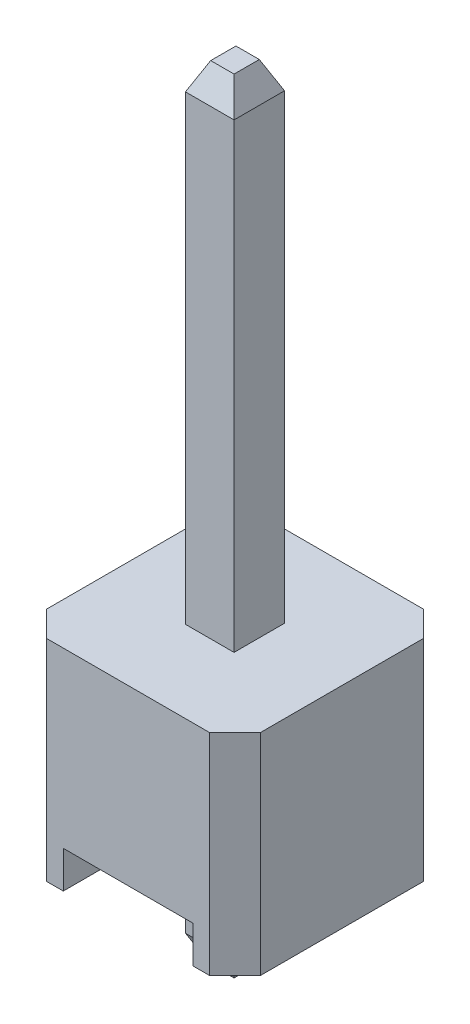
ISO-10303-21;
HEADER;
FILE_DESCRIPTION(('STEP AP214'),'2;1');
FILE_NAME('part.step','',(''),(''),'','','');
FILE_SCHEMA(('AUTOMOTIVE_DESIGN { 1 0 10303 214 1 1 1 1 }'));
ENDSEC;
DATA;
#1=APPLICATION_CONTEXT('core data for automotive mechanical design processes');
#2=APPLICATION_PROTOCOL_DEFINITION('international standard','automotive_design',2000,#1);
#3=PRODUCT_CONTEXT('',#1,'mechanical');
#4=PRODUCT('Part','Part','',(#3));
#5=PRODUCT_RELATED_PRODUCT_CATEGORY('part','',(#4));
#6=PRODUCT_DEFINITION_FORMATION('','',#4);
#7=PRODUCT_DEFINITION_CONTEXT('part definition',#1,'design');
#8=PRODUCT_DEFINITION('design','',#6,#7);
#9=PRODUCT_DEFINITION_SHAPE('','',#8);
#10=(LENGTH_UNIT() NAMED_UNIT(*) SI_UNIT(.MILLI.,.METRE.));
#11=(NAMED_UNIT(*) PLANE_ANGLE_UNIT() SI_UNIT($,.RADIAN.));
#12=(NAMED_UNIT(*) SI_UNIT($,.STERADIAN.) SOLID_ANGLE_UNIT());
#13=UNCERTAINTY_MEASURE_WITH_UNIT(LENGTH_MEASURE(1.E-05),#10,'distance_accuracy_value','');
#14=(GEOMETRIC_REPRESENTATION_CONTEXT(3) GLOBAL_UNCERTAINTY_ASSIGNED_CONTEXT((#13)) GLOBAL_UNIT_ASSIGNED_CONTEXT((#10,
#11,#12)) REPRESENTATION_CONTEXT('',''));
#15=CARTESIAN_POINT('',(0.,0.,0.));
#16=DIRECTION('',(0.,0.,1.));
#17=DIRECTION('',(1.,0.,0.));
#18=AXIS2_PLACEMENT_3D('',#15,#16,#17);
#19=CARTESIAN_POINT('',(-19.1812561045914,-5.69124998633488,-6.66837288882801));
#20=DIRECTION('',(0.,-1.,0.));
#21=DIRECTION('',(0.,0.,-1.));
#22=AXIS2_PLACEMENT_3D('',#19,#20,#21);
#23=PLANE('',#22);
#24=DIRECTION('',(0.,0.,1.));
#25=VECTOR('',#24,1.);
#26=CARTESIAN_POINT('',(-19.0312561045914,-5.69124998633488,-6.06837288882801));
#27=LINE('',#26,#25);
#28=CARTESIAN_POINT('',(-19.0312561045914,-5.69124998633488,-6.21837288882801));
#29=VERTEX_POINT('',#28);
#30=CARTESIAN_POINT('',(-19.0312561045914,-5.69124998633488,-6.51837288882801));
#31=VERTEX_POINT('',#30);
#32=EDGE_CURVE('E194',#29,#31,#27,.F.);
#33=ORIENTED_EDGE('',*,*,#32,.T.);
#34=DIRECTION('',(1.,0.,0.));
#35=VECTOR('',#34,1.);
#36=CARTESIAN_POINT('',(-19.1812561045914,-5.69124998633488,-6.51837288882801));
#37=LINE('',#36,#35);
#38=CARTESIAN_POINT('',(-18.7537499744834,-5.69124998633488,-6.51837288882801));
#39=VERTEX_POINT('',#38);
#40=EDGE_CURVE('E179',#31,#39,#37,.T.);
#41=ORIENTED_EDGE('',*,*,#40,.T.);
#42=DIRECTION('',(0.,0.,1.));
#43=VECTOR('',#42,1.);
#44=CARTESIAN_POINT('',(-18.7537499744834,-5.69124998633488,-6.66837288882801));
#45=LINE('',#44,#43);
#46=CARTESIAN_POINT('',(-18.7537499744834,-5.69124998633488,-6.21837288882801));
#47=VERTEX_POINT('',#46);
#48=EDGE_CURVE('E20',#39,#47,#45,.T.);
#49=ORIENTED_EDGE('',*,*,#48,.T.);
#50=DIRECTION('',(1.,0.,0.));
#51=VECTOR('',#50,1.);
#52=CARTESIAN_POINT('',(-18.6037499744834,-5.69124998633488,-6.21837288882801));
#53=LINE('',#52,#51);
#54=EDGE_CURVE('E174',#47,#29,#53,.F.);
#55=ORIENTED_EDGE('',*,*,#54,.T.);
#56=EDGE_LOOP('',(#33,#41,#49,#55));
#57=FACE_BOUND('',#56,.T.);
#58=ADVANCED_FACE('F17',(#57),#23,.T.);
#59=CARTESIAN_POINT('',(-18.6037499744834,-5.36957394825845,-6.66837288882801));
#60=DIRECTION('',(-0.90630778703665,0.4226182617407,0.));
#61=DIRECTION('',(-0.4226182617407,-0.90630778703665,0.));
#62=AXIS2_PLACEMENT_3D('',#59,#60,#61);
#63=PLANE('',#62);
#64=DIRECTION('',(0.,0.,-1.));
#65=VECTOR('',#64,1.);
#66=CARTESIAN_POINT('',(-18.6037499744834,-5.36957394825845,-6.66837288882801));
#67=LINE('',#66,#65);
#68=CARTESIAN_POINT('',(-18.6037499744834,-5.36957394825845,-6.06837288882801));
#69=VERTEX_POINT('',#68);
#70=CARTESIAN_POINT('',(-18.6037499744834,-5.36957394825845,-6.66837288882801));
#71=VERTEX_POINT('',#70);
#72=EDGE_CURVE('E186',#69,#71,#67,.T.);
#73=ORIENTED_EDGE('',*,*,#72,.F.);
#74=DIRECTION('',(-0.389281620635034,-0.834817129478984,-0.389281620635025));
#75=VECTOR('',#74,1.);
#76=CARTESIAN_POINT('',(-18.6037499744834,-5.36957394825845,-6.06837288882801));
#77=LINE('',#76,#75);
#78=EDGE_CURVE('E182',#69,#47,#77,.T.);
#79=ORIENTED_EDGE('',*,*,#78,.T.);
#80=ORIENTED_EDGE('',*,*,#48,.F.);
#81=DIRECTION('',(0.389281620635034,0.834817129478983,-0.389281620635025));
#82=VECTOR('',#81,1.);
#83=CARTESIAN_POINT('',(-18.7537499744834,-5.69124998633488,-6.51837288882801));
#84=LINE('',#83,#82);
#85=EDGE_CURVE('E202',#39,#71,#84,.T.);
#86=ORIENTED_EDGE('',*,*,#85,.T.);
#87=EDGE_LOOP('',(#73,#79,#80,#86));
#88=FACE_BOUND('',#87,.T.);
#89=ADVANCED_FACE('F184',(#88),#63,.F.);
#90=CARTESIAN_POINT('',(-18.6037499744834,-5.36957394825845,-6.06837288882801));
#91=DIRECTION('',(0.,0.422618261740701,-0.906307787036649));
#92=DIRECTION('',(0.,0.906307787036649,0.422618261740701));
#93=AXIS2_PLACEMENT_3D('',#90,#91,#92);
#94=PLANE('',#93);
#95=ORIENTED_EDGE('',*,*,#54,.F.);
#96=ORIENTED_EDGE('',*,*,#78,.F.);
#97=DIRECTION('',(1.,0.,0.));
#98=VECTOR('',#97,1.);
#99=CARTESIAN_POINT('',(-18.6037499744834,-5.36957394825845,-6.06837288882801));
#100=LINE('',#99,#98);
#101=CARTESIAN_POINT('',(-19.1812561045914,-5.36957394825845,-6.06837288882801));
#102=VERTEX_POINT('',#101);
#103=EDGE_CURVE('E205',#102,#69,#100,.T.);
#104=ORIENTED_EDGE('',*,*,#103,.F.);
#105=DIRECTION('',(0.389281620635027,-0.834817129478985,-0.389281620635029));
#106=VECTOR('',#105,1.);
#107=CARTESIAN_POINT('',(-19.1812561045914,-5.36957394825845,-6.06837288882801));
#108=LINE('',#107,#106);
#109=EDGE_CURVE('E191',#102,#29,#108,.T.);
#110=ORIENTED_EDGE('',*,*,#109,.T.);
#111=EDGE_LOOP('',(#95,#96,#104,#110));
#112=FACE_BOUND('',#111,.T.);
#113=ADVANCED_FACE('F189',(#112),#94,.F.);
#114=CARTESIAN_POINT('',(-19.1812561045914,-5.36957394825845,-6.06837288882801));
#115=DIRECTION('',(0.906307787036649,0.422618261740701,0.));
#116=DIRECTION('',(-0.422618261740701,0.906307787036649,0.));
#117=AXIS2_PLACEMENT_3D('',#114,#115,#116);
#118=PLANE('',#117);
#119=ORIENTED_EDGE('',*,*,#32,.F.);
#120=ORIENTED_EDGE('',*,*,#109,.F.);
#121=DIRECTION('',(0.,0.,1.));
#122=VECTOR('',#121,1.);
#123=CARTESIAN_POINT('',(-19.1812561045914,-5.36957394825845,-6.06837288882801));
#124=LINE('',#123,#122);
#125=CARTESIAN_POINT('',(-19.1812561045914,-5.36957394825845,-6.66837288882801));
#126=VERTEX_POINT('',#125);
#127=EDGE_CURVE('E211',#126,#102,#124,.T.);
#128=ORIENTED_EDGE('',*,*,#127,.F.);
#129=DIRECTION('',(0.389281620635027,-0.834817129478986,0.389281620635027));
#130=VECTOR('',#129,1.);
#131=CARTESIAN_POINT('',(-19.1812561045914,-5.36957394825845,-6.66837288882801));
#132=LINE('',#131,#130);
#133=EDGE_CURVE('E198',#126,#31,#132,.T.);
#134=ORIENTED_EDGE('',*,*,#133,.T.);
#135=EDGE_LOOP('',(#119,#120,#128,#134));
#136=FACE_BOUND('',#135,.T.);
#137=ADVANCED_FACE('F518',(#136),#118,.F.);
#138=CARTESIAN_POINT('',(-19.1812561045914,-5.36957394825845,-6.66837288882801));
#139=DIRECTION('',(0.,0.422618261740701,0.906307787036649));
#140=DIRECTION('',(0.,-0.906307787036649,0.422618261740701));
#141=AXIS2_PLACEMENT_3D('',#138,#139,#140);
#142=PLANE('',#141);
#143=ORIENTED_EDGE('',*,*,#40,.F.);
#144=ORIENTED_EDGE('',*,*,#133,.F.);
#145=DIRECTION('',(-1.,0.,0.));
#146=VECTOR('',#145,1.);
#147=CARTESIAN_POINT('',(-19.1812561045914,-5.36957394825845,-6.66837288882801));
#148=LINE('',#147,#146);
#149=EDGE_CURVE('E220',#71,#126,#148,.T.);
#150=ORIENTED_EDGE('',*,*,#149,.F.);
#151=ORIENTED_EDGE('',*,*,#85,.F.);
#152=EDGE_LOOP('',(#143,#144,#150,#151));
#153=FACE_BOUND('',#152,.T.);
#154=ADVANCED_FACE('F514',(#153),#142,.F.);
#155=CARTESIAN_POINT('',(-18.6037499744834,-5.69124998633488,-6.66837288882801));
#156=DIRECTION('',(1.,0.,0.));
#157=DIRECTION('',(0.,0.,-1.));
#158=AXIS2_PLACEMENT_3D('',#155,#156,#157);
#159=PLANE('',#158);
#160=DIRECTION('',(0.,1.,0.));
#161=VECTOR('',#160,1.);
#162=CARTESIAN_POINT('',(-18.6037499744834,-5.69124998633488,-6.66837288882801));
#163=LINE('',#162,#161);
#164=CARTESIAN_POINT('',(-18.6037499744834,-4.25124998633488,-6.66837288882801));
#165=VERTEX_POINT('',#164);
#166=EDGE_CURVE('E217',#165,#71,#163,.F.);
#167=ORIENTED_EDGE('',*,*,#166,.F.);
#168=DIRECTION('',(0.,0.,1.));
#169=VECTOR('',#168,1.);
#170=CARTESIAN_POINT('',(-18.6037499744834,-4.25124998633488,-5.09837288882801));
#171=LINE('',#170,#169);
#172=CARTESIAN_POINT('',(-18.6037499744834,-4.25124998633488,-6.06837288882801));
#173=VERTEX_POINT('',#172);
#174=EDGE_CURVE('E230',#165,#173,#171,.T.);
#175=ORIENTED_EDGE('',*,*,#174,.T.);
#176=DIRECTION('',(0.,1.,0.));
#177=VECTOR('',#176,1.);
#178=CARTESIAN_POINT('',(-18.6037499744834,-5.69124998633488,-6.06837288882801));
#179=LINE('',#178,#177);
#180=EDGE_CURVE('E208',#69,#173,#179,.T.);
#181=ORIENTED_EDGE('',*,*,#180,.F.);
#182=ORIENTED_EDGE('',*,*,#72,.T.);
#183=EDGE_LOOP('',(#167,#175,#181,#182));
#184=FACE_BOUND('',#183,.T.);
#185=ADVANCED_FACE('F510',(#184),#159,.T.);
#186=CARTESIAN_POINT('',(-18.6037499744834,-5.69124998633488,-6.06837288882801));
#187=DIRECTION('',(0.,0.,1.));
#188=DIRECTION('',(1.,0.,0.));
#189=AXIS2_PLACEMENT_3D('',#186,#187,#188);
#190=PLANE('',#189);
#191=ORIENTED_EDGE('',*,*,#180,.T.);
#192=DIRECTION('',(1.,0.,0.));
#193=VECTOR('',#192,1.);
#194=CARTESIAN_POINT('',(-18.1225030395374,-4.25124998633488,-6.06837288882801));
#195=LINE('',#194,#193);
#196=CARTESIAN_POINT('',(-19.1812561045914,-4.25124998633488,-6.06837288882801));
#197=VERTEX_POINT('',#196);
#198=EDGE_CURVE('E232',#173,#197,#195,.F.);
#199=ORIENTED_EDGE('',*,*,#198,.T.);
#200=DIRECTION('',(0.,1.,0.));
#201=VECTOR('',#200,1.);
#202=CARTESIAN_POINT('',(-19.1812561045914,-5.69124998633488,-6.06837288882801));
#203=LINE('',#202,#201);
#204=EDGE_CURVE('E214',#102,#197,#203,.T.);
#205=ORIENTED_EDGE('',*,*,#204,.F.);
#206=ORIENTED_EDGE('',*,*,#103,.T.);
#207=EDGE_LOOP('',(#191,#199,#205,#206));
#208=FACE_BOUND('',#207,.T.);
#209=ADVANCED_FACE('F506',(#208),#190,.T.);
#210=CARTESIAN_POINT('',(-19.1812561045914,-5.69124998633488,-6.06837288882801));
#211=DIRECTION('',(-1.,0.,0.));
#212=DIRECTION('',(0.,0.,1.));
#213=AXIS2_PLACEMENT_3D('',#210,#211,#212);
#214=PLANE('',#213);
#215=ORIENTED_EDGE('',*,*,#204,.T.);
#216=DIRECTION('',(0.,0.,1.));
#217=VECTOR('',#216,1.);
#218=CARTESIAN_POINT('',(-19.1812561045914,-4.25124998633488,-5.09837288882801));
#219=LINE('',#218,#217);
#220=CARTESIAN_POINT('',(-19.1812561045914,-4.25124998633488,-6.66837288882801));
#221=VERTEX_POINT('',#220);
#222=EDGE_CURVE('E234',#197,#221,#219,.F.);
#223=ORIENTED_EDGE('',*,*,#222,.T.);
#224=DIRECTION('',(0.,1.,0.));
#225=VECTOR('',#224,1.);
#226=CARTESIAN_POINT('',(-19.1812561045914,-5.69124998633488,-6.66837288882801));
#227=LINE('',#226,#225);
#228=EDGE_CURVE('E223',#126,#221,#227,.T.);
#229=ORIENTED_EDGE('',*,*,#228,.F.);
#230=ORIENTED_EDGE('',*,*,#127,.T.);
#231=EDGE_LOOP('',(#215,#223,#229,#230));
#232=FACE_BOUND('',#231,.T.);
#233=ADVANCED_FACE('F502',(#232),#214,.T.);
#234=CARTESIAN_POINT('',(-19.1812561045914,-5.69124998633488,-6.66837288882801));
#235=DIRECTION('',(0.,0.,-1.));
#236=DIRECTION('',(-1.,0.,0.));
#237=AXIS2_PLACEMENT_3D('',#234,#235,#236);
#238=PLANE('',#237);
#239=ORIENTED_EDGE('',*,*,#228,.T.);
#240=DIRECTION('',(1.,0.,0.));
#241=VECTOR('',#240,1.);
#242=CARTESIAN_POINT('',(-18.1225030395374,-4.25124998633488,-6.66837288882801));
#243=LINE('',#242,#241);
#244=EDGE_CURVE('E236',#221,#165,#243,.T.);
#245=ORIENTED_EDGE('',*,*,#244,.T.);
#246=ORIENTED_EDGE('',*,*,#166,.T.);
#247=ORIENTED_EDGE('',*,*,#149,.T.);
#248=EDGE_LOOP('',(#239,#245,#246,#247));
#249=FACE_BOUND('',#248,.T.);
#250=ADVANCED_FACE('F498',(#249),#238,.T.);
#251=CARTESIAN_POINT('',(-18.1225030395374,-4.25124998633488,-5.09837288882801));
#252=DIRECTION('',(0.,1.,0.));
#253=DIRECTION('',(0.,0.,1.));
#254=AXIS2_PLACEMENT_3D('',#251,#252,#253);
#255=PLANE('',#254);
#256=ORIENTED_EDGE('',*,*,#222,.F.);
#257=ORIENTED_EDGE('',*,*,#198,.F.);
#258=ORIENTED_EDGE('',*,*,#174,.F.);
#259=ORIENTED_EDGE('',*,*,#244,.F.);
#260=EDGE_LOOP('',(#256,#257,#258,#259));
#261=FACE_BOUND('',#260,.T.);
#262=DIRECTION('',(0.,0.,1.));
#263=VECTOR('',#262,1.);
#264=CARTESIAN_POINT('',(-19.6625030395374,-4.25124998633488,-5.09837288882801));
#265=LINE('',#264,#263);
#266=CARTESIAN_POINT('',(-19.6625030395374,-4.25124998633488,-5.09837288882801));
#267=VERTEX_POINT('',#266);
#268=CARTESIAN_POINT('',(-19.6625030395374,-4.25124998633488,-7.63837288882801));
#269=VERTEX_POINT('',#268);
#270=EDGE_CURVE('E241',#267,#269,#265,.F.);
#271=ORIENTED_EDGE('',*,*,#270,.T.);
#272=DIRECTION('',(1.,0.,0.));
#273=VECTOR('',#272,1.);
#274=CARTESIAN_POINT('',(-18.1225030395374,-4.25124998633488,-7.63837288882801));
#275=LINE('',#274,#273);
#276=CARTESIAN_POINT('',(-18.1225030395374,-4.25124998633488,-7.63837288882801));
#277=VERTEX_POINT('',#276);
#278=EDGE_CURVE('E226',#277,#269,#275,.F.);
#279=ORIENTED_EDGE('',*,*,#278,.F.);
#280=DIRECTION('',(0.,0.,-1.));
#281=VECTOR('',#280,1.);
#282=CARTESIAN_POINT('',(-18.1225030395374,-4.25124998633488,-5.09837288882801));
#283=LINE('',#282,#281);
#284=CARTESIAN_POINT('',(-18.1225030395374,-4.25124998633488,-5.09837288882801));
#285=VERTEX_POINT('',#284);
#286=EDGE_CURVE('E248',#277,#285,#283,.F.);
#287=ORIENTED_EDGE('',*,*,#286,.T.);
#288=DIRECTION('',(1.,0.,0.));
#289=VECTOR('',#288,1.);
#290=CARTESIAN_POINT('',(-18.1225030395374,-4.25124998633488,-5.09837288882801));
#291=LINE('',#290,#289);
#292=EDGE_CURVE('E228',#267,#285,#291,.T.);
#293=ORIENTED_EDGE('',*,*,#292,.F.);
#294=EDGE_LOOP('',(#271,#279,#287,#293));
#295=FACE_BOUND('',#294,.T.);
#296=ADVANCED_FACE('F495',(#261,#295),#255,.F.);
#297=CARTESIAN_POINT('',(-19.1812561045914,3.60875001366512,-6.51837288882801));
#298=DIRECTION('',(0.,0.422618261740697,-0.906307787036651));
#299=DIRECTION('',(0.,0.906307787036651,0.422618261740697));
#300=AXIS2_PLACEMENT_3D('',#297,#298,#299);
#301=PLANE('',#300);
#302=DIRECTION('',(-0.389281620635024,-0.834817129478989,-0.389281620635024));
#303=VECTOR('',#302,1.);
#304=CARTESIAN_POINT('',(-19.0312561045914,3.60875001366512,-6.51837288882801));
#305=LINE('',#304,#303);
#306=CARTESIAN_POINT('',(-19.0312561045914,3.60875001366512,-6.51837288882801));
#307=VERTEX_POINT('',#306);
#308=CARTESIAN_POINT('',(-19.1812561045914,3.28707397558869,-6.66837288882801));
#309=VERTEX_POINT('',#308);
#310=EDGE_CURVE('E263',#307,#309,#305,.T.);
#311=ORIENTED_EDGE('',*,*,#310,.F.);
#312=DIRECTION('',(1.,0.,0.));
#313=VECTOR('',#312,1.);
#314=CARTESIAN_POINT('',(-19.1812561045914,3.60875001366512,-6.51837288882801));
#315=LINE('',#314,#313);
#316=CARTESIAN_POINT('',(-18.7537499744834,3.60875001366512,-6.51837288882801));
#317=VERTEX_POINT('',#316);
#318=EDGE_CURVE('E256',#307,#317,#315,.T.);
#319=ORIENTED_EDGE('',*,*,#318,.T.);
#320=DIRECTION('',(-0.389281620635023,0.83481712947899,0.389281620635023));
#321=VECTOR('',#320,1.);
#322=CARTESIAN_POINT('',(-18.6037499744834,3.28707397558868,-6.66837288882801));
#323=LINE('',#322,#321);
#324=CARTESIAN_POINT('',(-18.6037499744834,3.28707397558869,-6.66837288882801));
#325=VERTEX_POINT('',#324);
#326=EDGE_CURVE('E253',#325,#317,#323,.T.);
#327=ORIENTED_EDGE('',*,*,#326,.F.);
#328=DIRECTION('',(-1.,0.,0.));
#329=VECTOR('',#328,1.);
#330=CARTESIAN_POINT('',(-19.1812561045914,3.28707397558869,-6.66837288882801));
#331=LINE('',#330,#329);
#332=EDGE_CURVE('E266',#309,#325,#331,.F.);
#333=ORIENTED_EDGE('',*,*,#332,.F.);
#334=EDGE_LOOP('',(#311,#319,#327,#333));
#335=FACE_BOUND('',#334,.T.);
#336=ADVANCED_FACE('F472',(#335),#301,.T.);
#337=CARTESIAN_POINT('',(-19.6625030395374,-4.25124998633488,-5.09837288882801));
#338=DIRECTION('',(-1.,0.,0.));
#339=DIRECTION('',(0.,0.,1.));
#340=AXIS2_PLACEMENT_3D('',#337,#338,#339);
#341=PLANE('',#340);
#342=DIRECTION('',(0.,1.,0.));
#343=VECTOR('',#342,1.);
#344=CARTESIAN_POINT('',(-19.6625030395374,-4.25124998633488,-7.63837288882801));
#345=LINE('',#344,#343);
#346=CARTESIAN_POINT('',(-19.6625030395374,-4.69124998633488,-7.63837288882801));
#347=VERTEX_POINT('',#346);
#348=EDGE_CURVE('E244',#269,#347,#345,.F.);
#349=ORIENTED_EDGE('',*,*,#348,.F.);
#350=ORIENTED_EDGE('',*,*,#270,.F.);
#351=DIRECTION('',(0.,1.,0.));
#352=VECTOR('',#351,1.);
#353=CARTESIAN_POINT('',(-19.6625030395374,-4.25124998633488,-5.09837288882801));
#354=LINE('',#353,#352);
#355=CARTESIAN_POINT('',(-19.6625030395374,-4.69124998633488,-5.09837288882801));
#356=VERTEX_POINT('',#355);
#357=EDGE_CURVE('E239',#356,#267,#354,.T.);
#358=ORIENTED_EDGE('',*,*,#357,.F.);
#359=DIRECTION('',(0.,0.,1.));
#360=VECTOR('',#359,1.);
#361=CARTESIAN_POINT('',(-19.6625030395374,-4.69124998633488,-6.36837288882801));
#362=LINE('',#361,#360);
#363=EDGE_CURVE('E273',#356,#347,#362,.F.);
#364=ORIENTED_EDGE('',*,*,#363,.T.);
#365=EDGE_LOOP('',(#349,#350,#358,#364));
#366=FACE_BOUND('',#365,.T.);
#367=ADVANCED_FACE('F488',(#366),#341,.F.);
#368=CARTESIAN_POINT('',(-18.1225030395374,-4.25124998633488,-5.09837288882801));
#369=DIRECTION('',(1.,0.,0.));
#370=DIRECTION('',(0.,0.,-1.));
#371=AXIS2_PLACEMENT_3D('',#368,#369,#370);
#372=PLANE('',#371);
#373=DIRECTION('',(0.,1.,0.));
#374=VECTOR('',#373,1.);
#375=CARTESIAN_POINT('',(-18.1225030395374,-4.25124998633488,-5.09837288882801));
#376=LINE('',#375,#374);
#377=CARTESIAN_POINT('',(-18.1225030395374,-4.69124998633488,-5.09837288882801));
#378=VERTEX_POINT('',#377);
#379=EDGE_CURVE('E251',#285,#378,#376,.F.);
#380=ORIENTED_EDGE('',*,*,#379,.F.);
#381=ORIENTED_EDGE('',*,*,#286,.F.);
#382=DIRECTION('',(0.,1.,0.));
#383=VECTOR('',#382,1.);
#384=CARTESIAN_POINT('',(-18.1225030395374,-4.25124998633488,-7.63837288882801));
#385=LINE('',#384,#383);
#386=CARTESIAN_POINT('',(-18.1225030395374,-4.69124998633488,-7.63837288882801));
#387=VERTEX_POINT('',#386);
#388=EDGE_CURVE('E246',#387,#277,#385,.T.);
#389=ORIENTED_EDGE('',*,*,#388,.F.);
#390=DIRECTION('',(0.,0.,1.));
#391=VECTOR('',#390,1.);
#392=CARTESIAN_POINT('',(-18.1225030395374,-4.69124998633488,-6.36837288882801));
#393=LINE('',#392,#391);
#394=EDGE_CURVE('E288',#387,#378,#393,.T.);
#395=ORIENTED_EDGE('',*,*,#394,.T.);
#396=EDGE_LOOP('',(#380,#381,#389,#395));
#397=FACE_BOUND('',#396,.T.);
#398=ADVANCED_FACE('F482',(#397),#372,.F.);
#399=CARTESIAN_POINT('',(-18.7537499744834,3.60875001366512,-6.66837288882801));
#400=DIRECTION('',(0.906307787036651,0.422618261740697,0.));
#401=DIRECTION('',(-0.422618261740697,0.906307787036651,0.));
#402=AXIS2_PLACEMENT_3D('',#399,#400,#401);
#403=PLANE('',#402);
#404=ORIENTED_EDGE('',*,*,#326,.T.);
#405=DIRECTION('',(0.,0.,-1.));
#406=VECTOR('',#405,1.);
#407=CARTESIAN_POINT('',(-18.7537499744834,3.60875001366512,-6.66837288882801));
#408=LINE('',#407,#406);
#409=CARTESIAN_POINT('',(-18.7537499744834,3.60875001366512,-6.21837288882801));
#410=VERTEX_POINT('',#409);
#411=EDGE_CURVE('E258',#317,#410,#408,.F.);
#412=ORIENTED_EDGE('',*,*,#411,.T.);
#413=DIRECTION('',(-0.389281620635031,0.834817129478986,-0.389281620635022));
#414=VECTOR('',#413,1.);
#415=CARTESIAN_POINT('',(-18.6037499744834,3.28707397558869,-6.06837288882801));
#416=LINE('',#415,#414);
#417=CARTESIAN_POINT('',(-18.6037499744834,3.28707397558869,-6.06837288882801));
#418=VERTEX_POINT('',#417);
#419=EDGE_CURVE('E310',#418,#410,#416,.T.);
#420=ORIENTED_EDGE('',*,*,#419,.F.);
#421=DIRECTION('',(0.,0.,-1.));
#422=VECTOR('',#421,1.);
#423=CARTESIAN_POINT('',(-18.6037499744834,3.28707397558869,-6.66837288882801));
#424=LINE('',#423,#422);
#425=EDGE_CURVE('E303',#325,#418,#424,.F.);
#426=ORIENTED_EDGE('',*,*,#425,.F.);
#427=EDGE_LOOP('',(#404,#412,#420,#426));
#428=FACE_BOUND('',#427,.T.);
#429=ADVANCED_FACE('F466',(#428),#403,.T.);
#430=CARTESIAN_POINT('',(-19.1812561045914,3.60875001366512,-6.66837288882801));
#431=DIRECTION('',(0.,-1.,0.));
#432=DIRECTION('',(0.,0.,-1.));
#433=AXIS2_PLACEMENT_3D('',#430,#431,#432);
#434=PLANE('',#433);
#435=ORIENTED_EDGE('',*,*,#318,.F.);
#436=DIRECTION('',(0.,0.,1.));
#437=VECTOR('',#436,1.);
#438=CARTESIAN_POINT('',(-19.0312561045914,3.60875001366512,-6.66837288882801));
#439=LINE('',#438,#437);
#440=CARTESIAN_POINT('',(-19.0312561045914,3.60875001366512,-6.21837288882801));
#441=VERTEX_POINT('',#440);
#442=EDGE_CURVE('E260',#441,#307,#439,.F.);
#443=ORIENTED_EDGE('',*,*,#442,.F.);
#444=DIRECTION('',(1.,0.,0.));
#445=VECTOR('',#444,1.);
#446=CARTESIAN_POINT('',(-19.1812561045914,3.60875001366512,-6.21837288882801));
#447=LINE('',#446,#445);
#448=EDGE_CURVE('E313',#410,#441,#447,.F.);
#449=ORIENTED_EDGE('',*,*,#448,.F.);
#450=ORIENTED_EDGE('',*,*,#411,.F.);
#451=EDGE_LOOP('',(#435,#443,#449,#450));
#452=FACE_BOUND('',#451,.T.);
#453=ADVANCED_FACE('F474',(#452),#434,.F.);
#454=CARTESIAN_POINT('',(-19.0312561045914,3.60875001366512,-6.66837288882801));
#455=DIRECTION('',(-0.906307787036651,0.422618261740697,0.));
#456=DIRECTION('',(-0.422618261740697,-0.906307787036651,0.));
#457=AXIS2_PLACEMENT_3D('',#454,#455,#456);
#458=PLANE('',#457);
#459=ORIENTED_EDGE('',*,*,#310,.T.);
#460=DIRECTION('',(0.,0.,1.));
#461=VECTOR('',#460,1.);
#462=CARTESIAN_POINT('',(-19.1812561045914,3.28707397558869,-6.06837288882801));
#463=LINE('',#462,#461);
#464=CARTESIAN_POINT('',(-19.1812561045914,3.28707397558869,-6.06837288882801));
#465=VERTEX_POINT('',#464);
#466=EDGE_CURVE('E316',#465,#309,#463,.F.);
#467=ORIENTED_EDGE('',*,*,#466,.F.);
#468=DIRECTION('',(-0.389281620635024,-0.834817129478989,0.389281620635024));
#469=VECTOR('',#468,1.);
#470=CARTESIAN_POINT('',(-19.0312561045914,3.60875001366512,-6.21837288882801));
#471=LINE('',#470,#469);
#472=EDGE_CURVE('E307',#441,#465,#471,.T.);
#473=ORIENTED_EDGE('',*,*,#472,.F.);
#474=ORIENTED_EDGE('',*,*,#442,.T.);
#475=EDGE_LOOP('',(#459,#467,#473,#474));
#476=FACE_BOUND('',#475,.T.);
#477=ADVANCED_FACE('F471',(#476),#458,.T.);
#478=CARTESIAN_POINT('',(-19.1812561045914,-5.69124998633488,-6.66837288882801));
#479=DIRECTION('',(0.,0.,-1.));
#480=DIRECTION('',(-1.,0.,0.));
#481=AXIS2_PLACEMENT_3D('',#478,#479,#480);
#482=PLANE('',#481);
#483=DIRECTION('',(0.,1.,0.));
#484=VECTOR('',#483,1.);
#485=CARTESIAN_POINT('',(-18.6037499744834,-5.69124998633488,-6.66837288882801));
#486=LINE('',#485,#484);
#487=CARTESIAN_POINT('',(-18.6037499744834,-2.19124998633488,-6.66837288882801));
#488=VERTEX_POINT('',#487);
#489=EDGE_CURVE('E300',#488,#325,#486,.T.);
#490=ORIENTED_EDGE('',*,*,#489,.F.);
#491=DIRECTION('',(-1.,0.,0.));
#492=VECTOR('',#491,1.);
#493=CARTESIAN_POINT('',(-19.1812561045914,-2.19124998633488,-6.66837288882801));
#494=LINE('',#493,#492);
#495=CARTESIAN_POINT('',(-19.1812561045914,-2.19124998633488,-6.66837288882801));
#496=VERTEX_POINT('',#495);
#497=EDGE_CURVE('E269',#488,#496,#494,.T.);
#498=ORIENTED_EDGE('',*,*,#497,.T.);
#499=DIRECTION('',(0.,1.,0.));
#500=VECTOR('',#499,1.);
#501=CARTESIAN_POINT('',(-19.1812561045914,-5.69124998633488,-6.66837288882801));
#502=LINE('',#501,#500);
#503=EDGE_CURVE('E319',#309,#496,#502,.F.);
#504=ORIENTED_EDGE('',*,*,#503,.F.);
#505=ORIENTED_EDGE('',*,*,#332,.T.);
#506=EDGE_LOOP('',(#490,#498,#504,#505));
#507=FACE_BOUND('',#506,.T.);
#508=ADVANCED_FACE('F462',(#507),#482,.T.);
#509=CARTESIAN_POINT('',(-21.1325030395374,-4.69124998633488,-6.36837288882801));
#510=DIRECTION('',(0.,1.,0.));
#511=DIRECTION('',(0.,0.,1.));
#512=AXIS2_PLACEMENT_3D('',#509,#510,#511);
#513=PLANE('',#512);
#514=ORIENTED_EDGE('',*,*,#363,.F.);
#515=DIRECTION('',(1.,0.,0.));
#516=VECTOR('',#515,1.);
#517=CARTESIAN_POINT('',(-21.1325030395374,-4.69124998633488,-5.09837288882801));
#518=LINE('',#517,#516);
#519=CARTESIAN_POINT('',(-19.8625030395374,-4.69124998633488,-5.09837288882801));
#520=VERTEX_POINT('',#519);
#521=EDGE_CURVE('E271',#520,#356,#518,.T.);
#522=ORIENTED_EDGE('',*,*,#521,.F.);
#523=DIRECTION('',(-0.707106781186549,0.,-0.707106781186546));
#524=VECTOR('',#523,1.);
#525=CARTESIAN_POINT('',(-20.1625030395374,-4.69124998633488,-5.39837288882801));
#526=LINE('',#525,#524);
#527=CARTESIAN_POINT('',(-20.1625030395374,-4.69124998633488,-5.39837288882801));
#528=VERTEX_POINT('',#527);
#529=EDGE_CURVE('E280',#520,#528,#526,.T.);
#530=ORIENTED_EDGE('',*,*,#529,.T.);
#531=DIRECTION('',(0.,0.,-1.));
#532=VECTOR('',#531,1.);
#533=CARTESIAN_POINT('',(-20.1625030395374,-4.69124998633488,-7.33837288882801));
#534=LINE('',#533,#532);
#535=CARTESIAN_POINT('',(-20.1625030395374,-4.69124998633488,-7.33837288882801));
#536=VERTEX_POINT('',#535);
#537=EDGE_CURVE('E330',#528,#536,#534,.T.);
#538=ORIENTED_EDGE('',*,*,#537,.T.);
#539=DIRECTION('',(0.707106781186549,0.,-0.707106781186546));
#540=VECTOR('',#539,1.);
#541=CARTESIAN_POINT('',(-19.8625030395374,-4.69124998633488,-7.63837288882801));
#542=LINE('',#541,#540);
#543=CARTESIAN_POINT('',(-19.8625030395374,-4.69124998633488,-7.63837288882801));
#544=VERTEX_POINT('',#543);
#545=EDGE_CURVE('E297',#536,#544,#542,.T.);
#546=ORIENTED_EDGE('',*,*,#545,.T.);
#547=DIRECTION('',(1.,0.,0.));
#548=VECTOR('',#547,1.);
#549=CARTESIAN_POINT('',(-21.1325030395374,-4.69124998633488,-7.63837288882801));
#550=LINE('',#549,#548);
#551=EDGE_CURVE('E276',#347,#544,#550,.F.);
#552=ORIENTED_EDGE('',*,*,#551,.F.);
#553=EDGE_LOOP('',(#514,#522,#530,#538,#546,#552));
#554=FACE_BOUND('',#553,.T.);
#555=ADVANCED_FACE('F630',(#554),#513,.F.);
#556=CARTESIAN_POINT('',(-20.1625030395374,-2.19124998633488,-5.39837288882801));
#557=DIRECTION('',(0.707106781186546,0.,-0.707106781186549));
#558=DIRECTION('',(-0.707106781186549,0.,-0.707106781186546));
#559=AXIS2_PLACEMENT_3D('',#556,#557,#558);
#560=PLANE('',#559);
#561=DIRECTION('',(0.,1.,0.));
#562=VECTOR('',#561,1.);
#563=CARTESIAN_POINT('',(-19.8625030395374,-2.19124998633488,-5.09837288882801));
#564=LINE('',#563,#562);
#565=CARTESIAN_POINT('',(-19.8625030395374,-2.19124998633488,-5.09837288882801));
#566=VERTEX_POINT('',#565);
#567=EDGE_CURVE('E333',#520,#566,#564,.T.);
#568=ORIENTED_EDGE('',*,*,#567,.T.);
#569=DIRECTION('',(-0.707106781186549,0.,-0.707106781186546));
#570=VECTOR('',#569,1.);
#571=CARTESIAN_POINT('',(-20.1625030395374,-2.19124998633488,-5.39837288882801));
#572=LINE('',#571,#570);
#573=CARTESIAN_POINT('',(-20.1625030395374,-2.19124998633488,-5.39837288882801));
#574=VERTEX_POINT('',#573);
#575=EDGE_CURVE('E278',#574,#566,#572,.F.);
#576=ORIENTED_EDGE('',*,*,#575,.F.);
#577=DIRECTION('',(0.,1.,0.));
#578=VECTOR('',#577,1.);
#579=CARTESIAN_POINT('',(-20.1625030395374,-2.19124998633488,-5.39837288882801));
#580=LINE('',#579,#578);
#581=EDGE_CURVE('E327',#574,#528,#580,.F.);
#582=ORIENTED_EDGE('',*,*,#581,.T.);
#583=ORIENTED_EDGE('',*,*,#529,.F.);
#584=EDGE_LOOP('',(#568,#576,#582,#583));
#585=FACE_BOUND('',#584,.T.);
#586=ADVANCED_FACE('F395',(#585),#560,.F.);
#587=CARTESIAN_POINT('',(-17.9225030395374,-2.19124998633488,-5.09837288882801));
#588=DIRECTION('',(-0.707106781186549,0.,-0.707106781186546));
#589=DIRECTION('',(-0.707106781186546,0.,0.707106781186549));
#590=AXIS2_PLACEMENT_3D('',#587,#588,#589);
#591=PLANE('',#590);
#592=DIRECTION('',(0.,1.,0.));
#593=VECTOR('',#592,1.);
#594=CARTESIAN_POINT('',(-17.6225030395374,-2.19124998633488,-5.39837288882801));
#595=LINE('',#594,#593);
#596=CARTESIAN_POINT('',(-17.6225030395374,-4.69124998633488,-5.39837288882801));
#597=VERTEX_POINT('',#596);
#598=CARTESIAN_POINT('',(-17.6225030395374,-2.19124998633488,-5.39837288882801));
#599=VERTEX_POINT('',#598);
#600=EDGE_CURVE('E341',#597,#599,#595,.T.);
#601=ORIENTED_EDGE('',*,*,#600,.T.);
#602=DIRECTION('',(-0.707106781186546,0.,0.707106781186549));
#603=VECTOR('',#602,1.);
#604=CARTESIAN_POINT('',(-17.9225030395374,-2.19124998633488,-5.09837288882801));
#605=LINE('',#604,#603);
#606=CARTESIAN_POINT('',(-17.9225030395374,-2.19124998633488,-5.09837288882801));
#607=VERTEX_POINT('',#606);
#608=EDGE_CURVE('E282',#607,#599,#605,.F.);
#609=ORIENTED_EDGE('',*,*,#608,.F.);
#610=DIRECTION('',(0.,1.,0.));
#611=VECTOR('',#610,1.);
#612=CARTESIAN_POINT('',(-17.9225030395374,-2.19124998633488,-5.09837288882801));
#613=LINE('',#612,#611);
#614=CARTESIAN_POINT('',(-17.9225030395374,-4.69124998633488,-5.09837288882801));
#615=VERTEX_POINT('',#614);
#616=EDGE_CURVE('E336',#607,#615,#613,.F.);
#617=ORIENTED_EDGE('',*,*,#616,.T.);
#618=DIRECTION('',(0.707106781186545,0.,-0.70710678118655));
#619=VECTOR('',#618,1.);
#620=CARTESIAN_POINT('',(-17.9225030395374,-4.69124998633488,-5.09837288882801));
#621=LINE('',#620,#619);
#622=EDGE_CURVE('E284',#615,#597,#621,.T.);
#623=ORIENTED_EDGE('',*,*,#622,.T.);
#624=EDGE_LOOP('',(#601,#609,#617,#623));
#625=FACE_BOUND('',#624,.T.);
#626=ADVANCED_FACE('F402',(#625),#591,.F.);
#627=CARTESIAN_POINT('',(-21.1325030395374,-4.69124998633488,-6.36837288882801));
#628=DIRECTION('',(0.,1.,0.));
#629=DIRECTION('',(0.,0.,1.));
#630=AXIS2_PLACEMENT_3D('',#627,#628,#629);
#631=PLANE('',#630);
#632=ORIENTED_EDGE('',*,*,#394,.F.);
#633=DIRECTION('',(1.,0.,0.));
#634=VECTOR('',#633,1.);
#635=CARTESIAN_POINT('',(-21.1325030395374,-4.69124998633488,-7.63837288882801));
#636=LINE('',#635,#634);
#637=CARTESIAN_POINT('',(-17.9225030395374,-4.69124998633488,-7.63837288882801));
#638=VERTEX_POINT('',#637);
#639=EDGE_CURVE('E286',#638,#387,#636,.F.);
#640=ORIENTED_EDGE('',*,*,#639,.F.);
#641=DIRECTION('',(0.707106781186547,0.,0.707106781186548));
#642=VECTOR('',#641,1.);
#643=CARTESIAN_POINT('',(-17.6225030395374,-4.69124998633488,-7.33837288882801));
#644=LINE('',#643,#642);
#645=CARTESIAN_POINT('',(-17.6225030395374,-4.69124998633488,-7.33837288882801));
#646=VERTEX_POINT('',#645);
#647=EDGE_CURVE('E293',#638,#646,#644,.T.);
#648=ORIENTED_EDGE('',*,*,#647,.T.);
#649=DIRECTION('',(0.,0.,1.));
#650=VECTOR('',#649,1.);
#651=CARTESIAN_POINT('',(-17.6225030395374,-4.69124998633488,-5.39837288882801));
#652=LINE('',#651,#650);
#653=EDGE_CURVE('E347',#646,#597,#652,.T.);
#654=ORIENTED_EDGE('',*,*,#653,.T.);
#655=ORIENTED_EDGE('',*,*,#622,.F.);
#656=DIRECTION('',(-1.,0.,0.));
#657=VECTOR('',#656,1.);
#658=CARTESIAN_POINT('',(-19.8625030395374,-4.69124998633488,-5.09837288882801));
#659=LINE('',#658,#657);
#660=EDGE_CURVE('E338',#615,#378,#659,.T.);
#661=ORIENTED_EDGE('',*,*,#660,.T.);
#662=EDGE_LOOP('',(#632,#640,#648,#654,#655,#661));
#663=FACE_BOUND('',#662,.T.);
#664=ADVANCED_FACE('F405',(#663),#631,.F.);
#665=CARTESIAN_POINT('',(-17.6225030395374,-2.19124998633488,-7.33837288882801));
#666=DIRECTION('',(-0.707106781186548,0.,0.707106781186547));
#667=DIRECTION('',(0.707106781186547,0.,0.707106781186548));
#668=AXIS2_PLACEMENT_3D('',#665,#666,#667);
#669=PLANE('',#668);
#670=DIRECTION('',(0.,1.,0.));
#671=VECTOR('',#670,1.);
#672=CARTESIAN_POINT('',(-17.9225030395374,-2.19124998633488,-7.63837288882801));
#673=LINE('',#672,#671);
#674=CARTESIAN_POINT('',(-17.9225030395374,-2.19124998633488,-7.63837288882801));
#675=VERTEX_POINT('',#674);
#676=EDGE_CURVE('E350',#638,#675,#673,.T.);
#677=ORIENTED_EDGE('',*,*,#676,.T.);
#678=DIRECTION('',(0.707106781186547,0.,0.707106781186548));
#679=VECTOR('',#678,1.);
#680=CARTESIAN_POINT('',(-17.6225030395374,-2.19124998633488,-7.33837288882801));
#681=LINE('',#680,#679);
#682=CARTESIAN_POINT('',(-17.6225030395374,-2.19124998633488,-7.33837288882801));
#683=VERTEX_POINT('',#682);
#684=EDGE_CURVE('E291',#683,#675,#681,.F.);
#685=ORIENTED_EDGE('',*,*,#684,.F.);
#686=DIRECTION('',(0.,1.,0.));
#687=VECTOR('',#686,1.);
#688=CARTESIAN_POINT('',(-17.6225030395374,-2.19124998633488,-7.33837288882801));
#689=LINE('',#688,#687);
#690=EDGE_CURVE('E344',#683,#646,#689,.F.);
#691=ORIENTED_EDGE('',*,*,#690,.T.);
#692=ORIENTED_EDGE('',*,*,#647,.F.);
#693=EDGE_LOOP('',(#677,#685,#691,#692));
#694=FACE_BOUND('',#693,.T.);
#695=ADVANCED_FACE('F414',(#694),#669,.F.);
#696=CARTESIAN_POINT('',(-19.8625030395374,-2.19124998633488,-7.63837288882801));
#697=DIRECTION('',(0.707106781186546,0.,0.707106781186549));
#698=DIRECTION('',(0.707106781186549,0.,-0.707106781186546));
#699=AXIS2_PLACEMENT_3D('',#696,#697,#698);
#700=PLANE('',#699);
#701=DIRECTION('',(0.,1.,0.));
#702=VECTOR('',#701,1.);
#703=CARTESIAN_POINT('',(-20.1625030395374,-2.19124998633488,-7.33837288882801));
#704=LINE('',#703,#702);
#705=CARTESIAN_POINT('',(-20.1625030395374,-2.19124998633488,-7.33837288882801));
#706=VERTEX_POINT('',#705);
#707=EDGE_CURVE('E324',#536,#706,#704,.T.);
#708=ORIENTED_EDGE('',*,*,#707,.T.);
#709=DIRECTION('',(0.707106781186549,0.,-0.707106781186546));
#710=VECTOR('',#709,1.);
#711=CARTESIAN_POINT('',(-19.8625030395374,-2.19124998633488,-7.63837288882801));
#712=LINE('',#711,#710);
#713=CARTESIAN_POINT('',(-19.8625030395374,-2.19124998633488,-7.63837288882801));
#714=VERTEX_POINT('',#713);
#715=EDGE_CURVE('E295',#714,#706,#712,.F.);
#716=ORIENTED_EDGE('',*,*,#715,.F.);
#717=DIRECTION('',(0.,1.,0.));
#718=VECTOR('',#717,1.);
#719=CARTESIAN_POINT('',(-19.8625030395374,-2.19124998633488,-7.63837288882801));
#720=LINE('',#719,#718);
#721=EDGE_CURVE('E353',#714,#544,#720,.F.);
#722=ORIENTED_EDGE('',*,*,#721,.T.);
#723=ORIENTED_EDGE('',*,*,#545,.F.);
#724=EDGE_LOOP('',(#708,#716,#722,#723));
#725=FACE_BOUND('',#724,.T.);
#726=ADVANCED_FACE('F384',(#725),#700,.F.);
#727=CARTESIAN_POINT('',(-18.6037499744834,-5.69124998633488,-6.66837288882801));
#728=DIRECTION('',(1.,0.,0.));
#729=DIRECTION('',(0.,0.,-1.));
#730=AXIS2_PLACEMENT_3D('',#727,#728,#729);
#731=PLANE('',#730);
#732=DIRECTION('',(0.,1.,0.));
#733=VECTOR('',#732,1.);
#734=CARTESIAN_POINT('',(-18.6037499744834,-5.69124998633488,-6.06837288882801));
#735=LINE('',#734,#733);
#736=CARTESIAN_POINT('',(-18.6037499744834,-2.19124998633488,-6.06837288882801));
#737=VERTEX_POINT('',#736);
#738=EDGE_CURVE('E356',#737,#418,#735,.T.);
#739=ORIENTED_EDGE('',*,*,#738,.F.);
#740=DIRECTION('',(0.,0.,-1.));
#741=VECTOR('',#740,1.);
#742=CARTESIAN_POINT('',(-18.6037499744834,-2.19124998633488,-6.66837288882801));
#743=LINE('',#742,#741);
#744=EDGE_CURVE('E34',#737,#488,#743,.T.);
#745=ORIENTED_EDGE('',*,*,#744,.T.);
#746=ORIENTED_EDGE('',*,*,#489,.T.);
#747=ORIENTED_EDGE('',*,*,#425,.T.);
#748=EDGE_LOOP('',(#739,#745,#746,#747));
#749=FACE_BOUND('',#748,.T.);
#750=ADVANCED_FACE('F422',(#749),#731,.T.);
#751=CARTESIAN_POINT('',(-19.1812561045914,3.60875001366512,-6.21837288882801));
#752=DIRECTION('',(0.,0.422618261740697,0.906307787036651));
#753=DIRECTION('',(0.,-0.906307787036651,0.422618261740697));
#754=AXIS2_PLACEMENT_3D('',#751,#752,#753);
#755=PLANE('',#754);
#756=ORIENTED_EDGE('',*,*,#419,.T.);
#757=ORIENTED_EDGE('',*,*,#448,.T.);
#758=ORIENTED_EDGE('',*,*,#472,.T.);
#759=DIRECTION('',(1.,0.,0.));
#760=VECTOR('',#759,1.);
#761=CARTESIAN_POINT('',(-18.6037499744834,3.28707397558869,-6.06837288882801));
#762=LINE('',#761,#760);
#763=EDGE_CURVE('E359',#418,#465,#762,.F.);
#764=ORIENTED_EDGE('',*,*,#763,.F.);
#765=EDGE_LOOP('',(#756,#757,#758,#764));
#766=FACE_BOUND('',#765,.T.);
#767=ADVANCED_FACE('F445',(#766),#755,.T.);
#768=CARTESIAN_POINT('',(-19.1812561045914,-5.69124998633488,-6.06837288882801));
#769=DIRECTION('',(-1.,0.,0.));
#770=DIRECTION('',(0.,0.,1.));
#771=AXIS2_PLACEMENT_3D('',#768,#769,#770);
#772=PLANE('',#771);
#773=ORIENTED_EDGE('',*,*,#503,.T.);
#774=DIRECTION('',(0.,0.,1.));
#775=VECTOR('',#774,1.);
#776=CARTESIAN_POINT('',(-19.1812561045914,-2.19124998633488,-6.06837288882801));
#777=LINE('',#776,#775);
#778=CARTESIAN_POINT('',(-19.1812561045914,-2.19124998633488,-6.06837288882801));
#779=VERTEX_POINT('',#778);
#780=EDGE_CURVE('E322',#496,#779,#777,.T.);
#781=ORIENTED_EDGE('',*,*,#780,.T.);
#782=DIRECTION('',(0.,1.,0.));
#783=VECTOR('',#782,1.);
#784=CARTESIAN_POINT('',(-19.1812561045914,-5.69124998633488,-6.06837288882801));
#785=LINE('',#784,#783);
#786=EDGE_CURVE('E362',#465,#779,#785,.F.);
#787=ORIENTED_EDGE('',*,*,#786,.F.);
#788=ORIENTED_EDGE('',*,*,#466,.T.);
#789=EDGE_LOOP('',(#773,#781,#787,#788));
#790=FACE_BOUND('',#789,.T.);
#791=ADVANCED_FACE('F442',(#790),#772,.T.);
#792=CARTESIAN_POINT('',(-20.1625030395374,-2.19124998633488,-7.33837288882801));
#793=DIRECTION('',(1.,0.,0.));
#794=DIRECTION('',(0.,0.,-1.));
#795=AXIS2_PLACEMENT_3D('',#792,#793,#794);
#796=PLANE('',#795);
#797=ORIENTED_EDGE('',*,*,#581,.F.);
#798=DIRECTION('',(0.,0.,1.));
#799=VECTOR('',#798,1.);
#800=CARTESIAN_POINT('',(-20.1625030395374,-2.19124998633488,-6.36837288882801));
#801=LINE('',#800,#799);
#802=EDGE_CURVE('E365',#706,#574,#801,.T.);
#803=ORIENTED_EDGE('',*,*,#802,.F.);
#804=ORIENTED_EDGE('',*,*,#707,.F.);
#805=ORIENTED_EDGE('',*,*,#537,.F.);
#806=EDGE_LOOP('',(#797,#803,#804,#805));
#807=FACE_BOUND('',#806,.T.);
#808=ADVANCED_FACE('F390',(#807),#796,.F.);
#809=CARTESIAN_POINT('',(-19.8625030395374,-2.19124998633488,-5.09837288882801));
#810=DIRECTION('',(0.,0.,-1.));
#811=DIRECTION('',(-1.,0.,0.));
#812=AXIS2_PLACEMENT_3D('',#809,#810,#811);
#813=PLANE('',#812);
#814=ORIENTED_EDGE('',*,*,#379,.T.);
#815=ORIENTED_EDGE('',*,*,#660,.F.);
#816=ORIENTED_EDGE('',*,*,#616,.F.);
#817=DIRECTION('',(1.,0.,0.));
#818=VECTOR('',#817,1.);
#819=CARTESIAN_POINT('',(-21.1325030395374,-2.19124998633488,-5.09837288882801));
#820=LINE('',#819,#818);
#821=EDGE_CURVE('E368',#566,#607,#820,.T.);
#822=ORIENTED_EDGE('',*,*,#821,.F.);
#823=ORIENTED_EDGE('',*,*,#567,.F.);
#824=ORIENTED_EDGE('',*,*,#521,.T.);
#825=ORIENTED_EDGE('',*,*,#357,.T.);
#826=ORIENTED_EDGE('',*,*,#292,.T.);
#827=EDGE_LOOP('',(#814,#815,#816,#822,#823,#824,#825,#826));
#828=FACE_BOUND('',#827,.T.);
#829=ADVANCED_FACE('F398',(#828),#813,.F.);
#830=CARTESIAN_POINT('',(-17.6225030395374,-2.19124998633488,-5.39837288882801));
#831=DIRECTION('',(-1.,0.,0.));
#832=DIRECTION('',(0.,0.,1.));
#833=AXIS2_PLACEMENT_3D('',#830,#831,#832);
#834=PLANE('',#833);
#835=ORIENTED_EDGE('',*,*,#690,.F.);
#836=DIRECTION('',(0.,0.,1.));
#837=VECTOR('',#836,1.);
#838=CARTESIAN_POINT('',(-17.6225030395374,-2.19124998633488,-6.36837288882801));
#839=LINE('',#838,#837);
#840=EDGE_CURVE('E371',#599,#683,#839,.F.);
#841=ORIENTED_EDGE('',*,*,#840,.F.);
#842=ORIENTED_EDGE('',*,*,#600,.F.);
#843=ORIENTED_EDGE('',*,*,#653,.F.);
#844=EDGE_LOOP('',(#835,#841,#842,#843));
#845=FACE_BOUND('',#844,.T.);
#846=ADVANCED_FACE('F412',(#845),#834,.F.);
#847=CARTESIAN_POINT('',(-17.9225030395374,-2.19124998633488,-7.63837288882801));
#848=DIRECTION('',(0.,0.,1.));
#849=DIRECTION('',(1.,0.,0.));
#850=AXIS2_PLACEMENT_3D('',#847,#848,#849);
#851=PLANE('',#850);
#852=ORIENTED_EDGE('',*,*,#388,.T.);
#853=ORIENTED_EDGE('',*,*,#278,.T.);
#854=ORIENTED_EDGE('',*,*,#348,.T.);
#855=ORIENTED_EDGE('',*,*,#551,.T.);
#856=ORIENTED_EDGE('',*,*,#721,.F.);
#857=DIRECTION('',(1.,0.,0.));
#858=VECTOR('',#857,1.);
#859=CARTESIAN_POINT('',(-21.1325030395374,-2.19124998633488,-7.63837288882801));
#860=LINE('',#859,#858);
#861=EDGE_CURVE('E26',#675,#714,#860,.F.);
#862=ORIENTED_EDGE('',*,*,#861,.F.);
#863=ORIENTED_EDGE('',*,*,#676,.F.);
#864=ORIENTED_EDGE('',*,*,#639,.T.);
#865=EDGE_LOOP('',(#852,#853,#854,#855,#856,#862,#863,#864));
#866=FACE_BOUND('',#865,.T.);
#867=ADVANCED_FACE('F381',(#866),#851,.F.);
#868=CARTESIAN_POINT('',(-18.6037499744834,-5.69124998633488,-6.06837288882801));
#869=DIRECTION('',(0.,0.,1.));
#870=DIRECTION('',(1.,0.,0.));
#871=AXIS2_PLACEMENT_3D('',#868,#869,#870);
#872=PLANE('',#871);
#873=ORIENTED_EDGE('',*,*,#786,.T.);
#874=DIRECTION('',(1.,0.,0.));
#875=VECTOR('',#874,1.);
#876=CARTESIAN_POINT('',(-21.1325030395374,-2.19124998633488,-6.06837288882801));
#877=LINE('',#876,#875);
#878=EDGE_CURVE('E11',#737,#779,#877,.F.);
#879=ORIENTED_EDGE('',*,*,#878,.F.);
#880=ORIENTED_EDGE('',*,*,#738,.T.);
#881=ORIENTED_EDGE('',*,*,#763,.T.);
#882=EDGE_LOOP('',(#873,#879,#880,#881));
#883=FACE_BOUND('',#882,.T.);
#884=ADVANCED_FACE('F426',(#883),#872,.T.);
#885=CARTESIAN_POINT('',(-21.1325030395374,-2.19124998633488,-6.36837288882801));
#886=DIRECTION('',(0.,1.,0.));
#887=DIRECTION('',(0.,0.,1.));
#888=AXIS2_PLACEMENT_3D('',#885,#886,#887);
#889=PLANE('',#888);
#890=ORIENTED_EDGE('',*,*,#744,.F.);
#891=ORIENTED_EDGE('',*,*,#878,.T.);
#892=ORIENTED_EDGE('',*,*,#780,.F.);
#893=ORIENTED_EDGE('',*,*,#497,.F.);
#894=EDGE_LOOP('',(#890,#891,#892,#893));
#895=FACE_BOUND('',#894,.T.);
#896=ORIENTED_EDGE('',*,*,#684,.T.);
#897=ORIENTED_EDGE('',*,*,#861,.T.);
#898=ORIENTED_EDGE('',*,*,#715,.T.);
#899=ORIENTED_EDGE('',*,*,#802,.T.);
#900=ORIENTED_EDGE('',*,*,#575,.T.);
#901=ORIENTED_EDGE('',*,*,#821,.T.);
#902=ORIENTED_EDGE('',*,*,#608,.T.);
#903=ORIENTED_EDGE('',*,*,#840,.T.);
#904=EDGE_LOOP('',(#896,#897,#898,#899,#900,#901,#902,#903));
#905=FACE_BOUND('',#904,.T.);
#906=ADVANCED_FACE('F377',(#895,#905),#889,.T.);
#907=CLOSED_SHELL('',(#58,#89,#113,#137,#154,#185,#209,#233,#250,#296,#336,#367,#398,#429,#453,
#477,#508,#555,#586,#626,#664,#695,#726,#750,#767,#791,#808,#829,#846,#867,#884,#906));
#908=MANIFOLD_SOLID_BREP('B1',#907);
#909=ADVANCED_BREP_SHAPE_REPRESENTATION('',(#18,#908),#14);
#910=SHAPE_DEFINITION_REPRESENTATION(#9,#909);
ENDSEC;
END-ISO-10303-21;
